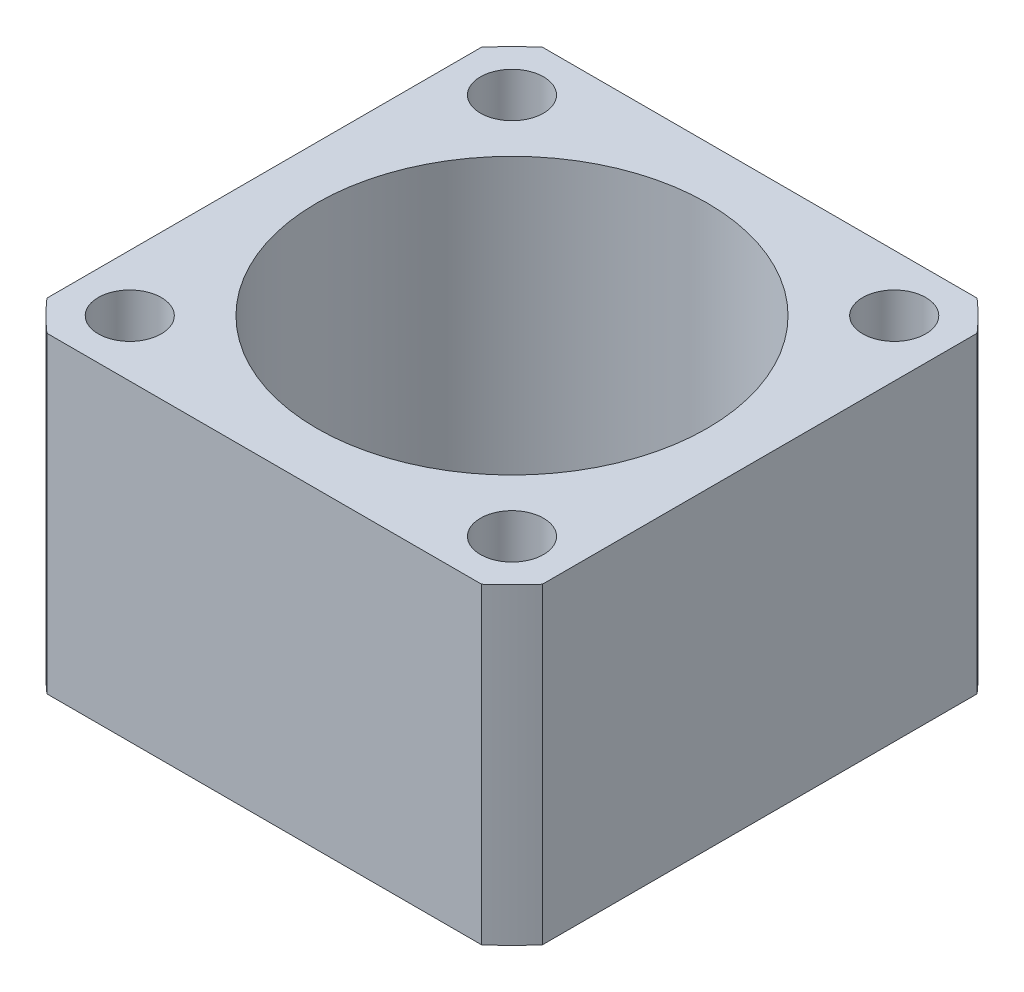
ISO-10303-21;
HEADER;
FILE_DESCRIPTION(('STEP AP214'),'2;1');
FILE_NAME('part.step','',(''),(''),'','','');
FILE_SCHEMA(('AUTOMOTIVE_DESIGN { 1 0 10303 214 1 1 1 1 }'));
ENDSEC;
DATA;
#1=APPLICATION_CONTEXT('core data for automotive mechanical design processes');
#2=APPLICATION_PROTOCOL_DEFINITION('international standard','automotive_design',2000,#1);
#3=PRODUCT_CONTEXT('',#1,'mechanical');
#4=PRODUCT('Part','Part','',(#3));
#5=PRODUCT_RELATED_PRODUCT_CATEGORY('part','',(#4));
#6=PRODUCT_DEFINITION_FORMATION('','',#4);
#7=PRODUCT_DEFINITION_CONTEXT('part definition',#1,'design');
#8=PRODUCT_DEFINITION('design','',#6,#7);
#9=PRODUCT_DEFINITION_SHAPE('','',#8);
#10=(LENGTH_UNIT() NAMED_UNIT(*) SI_UNIT(.MILLI.,.METRE.));
#11=(NAMED_UNIT(*) PLANE_ANGLE_UNIT() SI_UNIT($,.RADIAN.));
#12=(NAMED_UNIT(*) SI_UNIT($,.STERADIAN.) SOLID_ANGLE_UNIT());
#13=UNCERTAINTY_MEASURE_WITH_UNIT(LENGTH_MEASURE(1.E-05),#10,'distance_accuracy_value','');
#14=(GEOMETRIC_REPRESENTATION_CONTEXT(3) GLOBAL_UNCERTAINTY_ASSIGNED_CONTEXT((#13)) GLOBAL_UNIT_ASSIGNED_CONTEXT((#10,
#11,#12)) REPRESENTATION_CONTEXT('',''));
#15=CARTESIAN_POINT('',(0.,0.,0.));
#16=DIRECTION('',(0.,0.,1.));
#17=DIRECTION('',(1.,0.,0.));
#18=AXIS2_PLACEMENT_3D('',#15,#16,#17);
#19=CARTESIAN_POINT('',(0.,10.4,0.));
#20=DIRECTION('',(0.,1.,0.));
#21=DIRECTION('',(1.,0.,0.));
#22=AXIS2_PLACEMENT_3D('',#19,#20,#21);
#23=PLANE('',#22);
#24=CARTESIAN_POINT('',(0.,10.4,0.));
#25=DIRECTION('',(0.,-1.,0.));
#26=DIRECTION('',(1.,0.,0.));
#27=AXIS2_PLACEMENT_3D('',#24,#25,#26);
#28=CIRCLE('',#27,6.5);
#29=CARTESIAN_POINT('',(-6.5,10.4,0.));
#30=VERTEX_POINT('',#29);
#31=EDGE_CURVE('E223',#30,#30,#28,.T.);
#32=ORIENTED_EDGE('',*,*,#31,.T.);
#33=EDGE_LOOP('',(#32));
#34=FACE_BOUND('',#33,.T.);
#35=CARTESIAN_POINT('',(-6.36396103067893,10.4,-6.36396103067893));
#36=DIRECTION('',(0.,-1.,0.));
#37=DIRECTION('',(1.,0.,0.));
#38=AXIS2_PLACEMENT_3D('',#35,#36,#37);
#39=CIRCLE('',#38,1.05);
#40=CARTESIAN_POINT('',(-7.41396103067893,10.4,-6.36396103067893));
#41=VERTEX_POINT('',#40);
#42=EDGE_CURVE('E218',#41,#41,#39,.T.);
#43=ORIENTED_EDGE('',*,*,#42,.T.);
#44=EDGE_LOOP('',(#43));
#45=FACE_BOUND('',#44,.T.);
#46=CARTESIAN_POINT('',(6.36396103067893,10.4,-6.36396103067893));
#47=DIRECTION('',(0.,-1.,0.));
#48=DIRECTION('',(1.,0.,0.));
#49=AXIS2_PLACEMENT_3D('',#46,#47,#48);
#50=CIRCLE('',#49,1.05);
#51=CARTESIAN_POINT('',(5.31396103067893,10.4,-6.36396103067893));
#52=VERTEX_POINT('',#51);
#53=EDGE_CURVE('E205',#52,#52,#50,.T.);
#54=ORIENTED_EDGE('',*,*,#53,.T.);
#55=EDGE_LOOP('',(#54));
#56=FACE_BOUND('',#55,.T.);
#57=CARTESIAN_POINT('',(-6.36396103067893,10.4,6.36396103067893));
#58=DIRECTION('',(0.,-1.,0.));
#59=DIRECTION('',(1.,0.,0.));
#60=AXIS2_PLACEMENT_3D('',#57,#58,#59);
#61=CIRCLE('',#60,1.05);
#62=CARTESIAN_POINT('',(-7.41396103067893,10.4,6.36396103067893));
#63=VERTEX_POINT('',#62);
#64=EDGE_CURVE('E170',#63,#63,#61,.T.);
#65=ORIENTED_EDGE('',*,*,#64,.T.);
#66=EDGE_LOOP('',(#65));
#67=FACE_BOUND('',#66,.T.);
#68=CARTESIAN_POINT('',(6.36396103067893,10.4,6.36396103067893));
#69=DIRECTION('',(0.,-1.,0.));
#70=DIRECTION('',(1.,0.,0.));
#71=AXIS2_PLACEMENT_3D('',#68,#69,#70);
#72=CIRCLE('',#71,1.05);
#73=CARTESIAN_POINT('',(5.31396103067893,10.4,6.36396103067893));
#74=VERTEX_POINT('',#73);
#75=EDGE_CURVE('E29',#74,#74,#72,.T.);
#76=ORIENTED_EDGE('',*,*,#75,.T.);
#77=EDGE_LOOP('',(#76));
#78=FACE_BOUND('',#77,.T.);
#79=DIRECTION('',(0.,0.,-1.));
#80=VECTOR('',#79,1.);
#81=CARTESIAN_POINT('',(8.25,10.4,-3.61898207373289));
#82=LINE('',#81,#80);
#83=CARTESIAN_POINT('',(8.25,10.4,7.23796414746578));
#84=VERTEX_POINT('',#83);
#85=CARTESIAN_POINT('',(8.25,10.4,-7.23796414746578));
#86=VERTEX_POINT('',#85);
#87=EDGE_CURVE('E229',#84,#86,#82,.T.);
#88=ORIENTED_EDGE('',*,*,#87,.T.);
#89=CARTESIAN_POINT('',(0.,10.4,0.));
#90=DIRECTION('',(0.,1.,0.));
#91=DIRECTION('',(1.,0.,0.));
#92=AXIS2_PLACEMENT_3D('',#89,#90,#91);
#93=CIRCLE('',#92,10.975);
#94=CARTESIAN_POINT('',(7.23796414746578,10.4,-8.25));
#95=VERTEX_POINT('',#94);
#96=EDGE_CURVE('E89',#86,#95,#93,.T.);
#97=ORIENTED_EDGE('',*,*,#96,.T.);
#98=DIRECTION('',(-1.,0.,0.));
#99=VECTOR('',#98,1.);
#100=CARTESIAN_POINT('',(-3.61898207373289,10.4,-8.25));
#101=LINE('',#100,#99);
#102=CARTESIAN_POINT('',(-7.23796414746578,10.4,-8.25));
#103=VERTEX_POINT('',#102);
#104=EDGE_CURVE('E240',#95,#103,#101,.T.);
#105=ORIENTED_EDGE('',*,*,#104,.T.);
#106=CARTESIAN_POINT('',(0.,10.4,0.));
#107=DIRECTION('',(0.,1.,0.));
#108=DIRECTION('',(1.,0.,0.));
#109=AXIS2_PLACEMENT_3D('',#106,#107,#108);
#110=CIRCLE('',#109,10.975);
#111=CARTESIAN_POINT('',(-8.25,10.4,-7.23796414746578));
#112=VERTEX_POINT('',#111);
#113=EDGE_CURVE('E101',#103,#112,#110,.T.);
#114=ORIENTED_EDGE('',*,*,#113,.T.);
#115=DIRECTION('',(0.,0.,1.));
#116=VECTOR('',#115,1.);
#117=CARTESIAN_POINT('',(-8.25,10.4,3.61898207373289));
#118=LINE('',#117,#116);
#119=CARTESIAN_POINT('',(-8.25,10.4,7.23796414746578));
#120=VERTEX_POINT('',#119);
#121=EDGE_CURVE('E226',#112,#120,#118,.T.);
#122=ORIENTED_EDGE('',*,*,#121,.T.);
#123=CARTESIAN_POINT('',(0.,10.4,0.));
#124=DIRECTION('',(0.,1.,0.));
#125=DIRECTION('',(1.,0.,0.));
#126=AXIS2_PLACEMENT_3D('',#123,#124,#125);
#127=CIRCLE('',#126,10.975);
#128=CARTESIAN_POINT('',(-7.23796414746578,10.4,8.25));
#129=VERTEX_POINT('',#128);
#130=EDGE_CURVE('E133',#120,#129,#127,.T.);
#131=ORIENTED_EDGE('',*,*,#130,.T.);
#132=DIRECTION('',(1.,0.,0.));
#133=VECTOR('',#132,1.);
#134=CARTESIAN_POINT('',(3.61898207373289,10.4,8.25));
#135=LINE('',#134,#133);
#136=CARTESIAN_POINT('',(7.23796414746578,10.4,8.25));
#137=VERTEX_POINT('',#136);
#138=EDGE_CURVE('E188',#129,#137,#135,.T.);
#139=ORIENTED_EDGE('',*,*,#138,.T.);
#140=CARTESIAN_POINT('',(0.,10.4,0.));
#141=DIRECTION('',(0.,1.,0.));
#142=DIRECTION('',(1.,0.,0.));
#143=AXIS2_PLACEMENT_3D('',#140,#141,#142);
#144=CIRCLE('',#143,10.975);
#145=EDGE_CURVE('E184',#137,#84,#144,.T.);
#146=ORIENTED_EDGE('',*,*,#145,.T.);
#147=EDGE_LOOP('',(#88,#97,#105,#114,#122,#131,#139,#146));
#148=FACE_BOUND('',#147,.T.);
#149=ADVANCED_FACE('F19',(#34,#45,#56,#67,#78,#148),#23,.T.);
#150=CARTESIAN_POINT('',(6.36396103067893,0.,6.36396103067893));
#151=DIRECTION('',(0.,1.,0.));
#152=DIRECTION('',(1.,0.,0.));
#153=AXIS2_PLACEMENT_3D('',#150,#151,#152);
#154=CYLINDRICAL_SURFACE('',#153,1.05);
#155=ORIENTED_EDGE('',*,*,#75,.F.);
#156=DIRECTION('',(0.,-1.,0.));
#157=VECTOR('',#156,1.);
#158=CARTESIAN_POINT('',(5.31396103067893,0.,6.36396103067893));
#159=LINE('',#158,#157);
#160=CARTESIAN_POINT('',(5.31396103067893,0.,6.36396103067893));
#161=VERTEX_POINT('',#160);
#162=EDGE_CURVE('E11',#74,#161,#159,.T.);
#163=ORIENTED_EDGE('',*,*,#162,.T.);
#164=CARTESIAN_POINT('',(6.36396103067893,0.,6.36396103067893));
#165=DIRECTION('',(0.,-1.,0.));
#166=DIRECTION('',(1.,0.,0.));
#167=AXIS2_PLACEMENT_3D('',#164,#165,#166);
#168=CIRCLE('',#167,1.05);
#169=EDGE_CURVE('E23',#161,#161,#168,.T.);
#170=ORIENTED_EDGE('',*,*,#169,.T.);
#171=ORIENTED_EDGE('',*,*,#162,.F.);
#172=EDGE_LOOP('',(#155,#163,#170,#171));
#173=FACE_BOUND('',#172,.T.);
#174=ADVANCED_FACE('F21',(#173),#154,.F.);
#175=CARTESIAN_POINT('',(-6.36396103067893,0.,6.36396103067893));
#176=DIRECTION('',(0.,1.,0.));
#177=DIRECTION('',(1.,0.,0.));
#178=AXIS2_PLACEMENT_3D('',#175,#176,#177);
#179=CYLINDRICAL_SURFACE('',#178,1.05);
#180=ORIENTED_EDGE('',*,*,#64,.F.);
#181=DIRECTION('',(0.,-1.,0.));
#182=VECTOR('',#181,1.);
#183=CARTESIAN_POINT('',(-7.41396103067893,0.,6.36396103067893));
#184=LINE('',#183,#182);
#185=CARTESIAN_POINT('',(-7.41396103067893,0.,6.36396103067893));
#186=VERTEX_POINT('',#185);
#187=EDGE_CURVE('E53',#63,#186,#184,.T.);
#188=ORIENTED_EDGE('',*,*,#187,.T.);
#189=CARTESIAN_POINT('',(-6.36396103067893,0.,6.36396103067893));
#190=DIRECTION('',(0.,-1.,0.));
#191=DIRECTION('',(1.,0.,0.));
#192=AXIS2_PLACEMENT_3D('',#189,#190,#191);
#193=CIRCLE('',#192,1.05);
#194=EDGE_CURVE('E169',#186,#186,#193,.T.);
#195=ORIENTED_EDGE('',*,*,#194,.T.);
#196=ORIENTED_EDGE('',*,*,#187,.F.);
#197=EDGE_LOOP('',(#180,#188,#195,#196));
#198=FACE_BOUND('',#197,.T.);
#199=ADVANCED_FACE('F167',(#198),#179,.F.);
#200=CARTESIAN_POINT('',(6.36396103067893,0.,-6.36396103067893));
#201=DIRECTION('',(0.,1.,0.));
#202=DIRECTION('',(1.,0.,0.));
#203=AXIS2_PLACEMENT_3D('',#200,#201,#202);
#204=CYLINDRICAL_SURFACE('',#203,1.05);
#205=ORIENTED_EDGE('',*,*,#53,.F.);
#206=DIRECTION('',(0.,-1.,0.));
#207=VECTOR('',#206,1.);
#208=CARTESIAN_POINT('',(5.31396103067893,0.,-6.36396103067893));
#209=LINE('',#208,#207);
#210=CARTESIAN_POINT('',(5.31396103067893,0.,-6.36396103067893));
#211=VERTEX_POINT('',#210);
#212=EDGE_CURVE('E179',#52,#211,#209,.T.);
#213=ORIENTED_EDGE('',*,*,#212,.T.);
#214=CARTESIAN_POINT('',(6.36396103067893,0.,-6.36396103067893));
#215=DIRECTION('',(0.,-1.,0.));
#216=DIRECTION('',(1.,0.,0.));
#217=AXIS2_PLACEMENT_3D('',#214,#215,#216);
#218=CIRCLE('',#217,1.05);
#219=EDGE_CURVE('E201',#211,#211,#218,.T.);
#220=ORIENTED_EDGE('',*,*,#219,.T.);
#221=ORIENTED_EDGE('',*,*,#212,.F.);
#222=EDGE_LOOP('',(#205,#213,#220,#221));
#223=FACE_BOUND('',#222,.T.);
#224=ADVANCED_FACE('F349',(#223),#204,.F.);
#225=CARTESIAN_POINT('',(-6.36396103067893,0.,-6.36396103067893));
#226=DIRECTION('',(0.,1.,0.));
#227=DIRECTION('',(1.,0.,0.));
#228=AXIS2_PLACEMENT_3D('',#225,#226,#227);
#229=CYLINDRICAL_SURFACE('',#228,1.05);
#230=ORIENTED_EDGE('',*,*,#42,.F.);
#231=DIRECTION('',(0.,-1.,0.));
#232=VECTOR('',#231,1.);
#233=CARTESIAN_POINT('',(-7.41396103067893,0.,-6.36396103067893));
#234=LINE('',#233,#232);
#235=CARTESIAN_POINT('',(-7.41396103067893,0.,-6.36396103067893));
#236=VERTEX_POINT('',#235);
#237=EDGE_CURVE('E209',#41,#236,#234,.T.);
#238=ORIENTED_EDGE('',*,*,#237,.T.);
#239=CARTESIAN_POINT('',(-6.36396103067893,0.,-6.36396103067893));
#240=DIRECTION('',(0.,-1.,0.));
#241=DIRECTION('',(1.,0.,0.));
#242=AXIS2_PLACEMENT_3D('',#239,#240,#241);
#243=CIRCLE('',#242,1.05);
#244=EDGE_CURVE('E199',#236,#236,#243,.T.);
#245=ORIENTED_EDGE('',*,*,#244,.T.);
#246=ORIENTED_EDGE('',*,*,#237,.F.);
#247=EDGE_LOOP('',(#230,#238,#245,#246));
#248=FACE_BOUND('',#247,.T.);
#249=ADVANCED_FACE('F347',(#248),#229,.F.);
#250=CARTESIAN_POINT('',(0.,0.,0.));
#251=DIRECTION('',(0.,1.,0.));
#252=DIRECTION('',(1.,0.,0.));
#253=AXIS2_PLACEMENT_3D('',#250,#251,#252);
#254=CYLINDRICAL_SURFACE('',#253,6.5);
#255=ORIENTED_EDGE('',*,*,#31,.F.);
#256=DIRECTION('',(0.,-1.,0.));
#257=VECTOR('',#256,1.);
#258=CARTESIAN_POINT('',(-6.5,0.,0.));
#259=LINE('',#258,#257);
#260=CARTESIAN_POINT('',(-6.5,0.,0.));
#261=VERTEX_POINT('',#260);
#262=EDGE_CURVE('E159',#30,#261,#259,.T.);
#263=ORIENTED_EDGE('',*,*,#262,.T.);
#264=CARTESIAN_POINT('',(0.,0.,0.));
#265=DIRECTION('',(0.,-1.,0.));
#266=DIRECTION('',(1.,0.,0.));
#267=AXIS2_PLACEMENT_3D('',#264,#265,#266);
#268=CIRCLE('',#267,6.5);
#269=EDGE_CURVE('E196',#261,#261,#268,.T.);
#270=ORIENTED_EDGE('',*,*,#269,.T.);
#271=ORIENTED_EDGE('',*,*,#262,.F.);
#272=EDGE_LOOP('',(#255,#263,#270,#271));
#273=FACE_BOUND('',#272,.T.);
#274=ADVANCED_FACE('F333',(#273),#254,.F.);
#275=CARTESIAN_POINT('',(0.,0.,0.));
#276=DIRECTION('',(0.,1.,0.));
#277=DIRECTION('',(1.,0.,0.));
#278=AXIS2_PLACEMENT_3D('',#275,#276,#277);
#279=CYLINDRICAL_SURFACE('',#278,10.975);
#280=DIRECTION('',(0.,-1.,0.));
#281=VECTOR('',#280,1.);
#282=CARTESIAN_POINT('',(8.25,0.,-7.23796414746578));
#283=LINE('',#282,#281);
#284=CARTESIAN_POINT('',(8.25,0.,-7.23796414746578));
#285=VERTEX_POINT('',#284);
#286=EDGE_CURVE('E244',#86,#285,#283,.T.);
#287=ORIENTED_EDGE('',*,*,#286,.T.);
#288=CARTESIAN_POINT('',(0.,0.,0.));
#289=DIRECTION('',(0.,1.,0.));
#290=DIRECTION('',(1.,0.,0.));
#291=AXIS2_PLACEMENT_3D('',#288,#289,#290);
#292=CIRCLE('',#291,10.975);
#293=CARTESIAN_POINT('',(7.23796414746578,0.,-8.25));
#294=VERTEX_POINT('',#293);
#295=EDGE_CURVE('E200',#285,#294,#292,.T.);
#296=ORIENTED_EDGE('',*,*,#295,.T.);
#297=DIRECTION('',(0.,1.,0.));
#298=VECTOR('',#297,1.);
#299=CARTESIAN_POINT('',(7.23796414746578,0.,-8.25));
#300=LINE('',#299,#298);
#301=EDGE_CURVE('E243',#294,#95,#300,.T.);
#302=ORIENTED_EDGE('',*,*,#301,.T.);
#303=ORIENTED_EDGE('',*,*,#96,.F.);
#304=EDGE_LOOP('',(#287,#296,#302,#303));
#305=FACE_BOUND('',#304,.T.);
#306=ADVANCED_FACE('F316',(#305),#279,.T.);
#307=CARTESIAN_POINT('',(0.,0.,0.));
#308=DIRECTION('',(0.,1.,0.));
#309=DIRECTION('',(1.,0.,0.));
#310=AXIS2_PLACEMENT_3D('',#307,#308,#309);
#311=CYLINDRICAL_SURFACE('',#310,10.975);
#312=DIRECTION('',(0.,1.,0.));
#313=VECTOR('',#312,1.);
#314=CARTESIAN_POINT('',(8.25,0.,7.23796414746578));
#315=LINE('',#314,#313);
#316=CARTESIAN_POINT('',(8.25,0.,7.23796414746578));
#317=VERTEX_POINT('',#316);
#318=EDGE_CURVE('E232',#317,#84,#315,.T.);
#319=ORIENTED_EDGE('',*,*,#318,.T.);
#320=ORIENTED_EDGE('',*,*,#145,.F.);
#321=DIRECTION('',(0.,-1.,0.));
#322=VECTOR('',#321,1.);
#323=CARTESIAN_POINT('',(7.23796414746578,0.,8.25));
#324=LINE('',#323,#322);
#325=CARTESIAN_POINT('',(7.23796414746578,0.,8.25));
#326=VERTEX_POINT('',#325);
#327=EDGE_CURVE('E195',#137,#326,#324,.T.);
#328=ORIENTED_EDGE('',*,*,#327,.T.);
#329=CARTESIAN_POINT('',(0.,0.,0.));
#330=DIRECTION('',(0.,1.,0.));
#331=DIRECTION('',(1.,0.,0.));
#332=AXIS2_PLACEMENT_3D('',#329,#330,#331);
#333=CIRCLE('',#332,10.975);
#334=EDGE_CURVE('E210',#326,#317,#333,.T.);
#335=ORIENTED_EDGE('',*,*,#334,.T.);
#336=EDGE_LOOP('',(#319,#320,#328,#335));
#337=FACE_BOUND('',#336,.T.);
#338=ADVANCED_FACE('F324',(#337),#311,.T.);
#339=CARTESIAN_POINT('',(0.,0.,0.));
#340=DIRECTION('',(0.,1.,0.));
#341=DIRECTION('',(1.,0.,0.));
#342=AXIS2_PLACEMENT_3D('',#339,#340,#341);
#343=CYLINDRICAL_SURFACE('',#342,10.975);
#344=DIRECTION('',(0.,-1.,0.));
#345=VECTOR('',#344,1.);
#346=CARTESIAN_POINT('',(-7.23796414746578,0.,-8.25));
#347=LINE('',#346,#345);
#348=CARTESIAN_POINT('',(-7.23796414746578,0.,-8.25));
#349=VERTEX_POINT('',#348);
#350=EDGE_CURVE('E185',#103,#349,#347,.T.);
#351=ORIENTED_EDGE('',*,*,#350,.T.);
#352=CARTESIAN_POINT('',(0.,0.,0.));
#353=DIRECTION('',(0.,1.,0.));
#354=DIRECTION('',(1.,0.,0.));
#355=AXIS2_PLACEMENT_3D('',#352,#353,#354);
#356=CIRCLE('',#355,10.975);
#357=CARTESIAN_POINT('',(-8.25,0.,-7.23796414746578));
#358=VERTEX_POINT('',#357);
#359=EDGE_CURVE('E235',#349,#358,#356,.T.);
#360=ORIENTED_EDGE('',*,*,#359,.T.);
#361=DIRECTION('',(0.,1.,0.));
#362=VECTOR('',#361,1.);
#363=CARTESIAN_POINT('',(-8.25,0.,-7.23796414746578));
#364=LINE('',#363,#362);
#365=EDGE_CURVE('E215',#358,#112,#364,.T.);
#366=ORIENTED_EDGE('',*,*,#365,.T.);
#367=ORIENTED_EDGE('',*,*,#113,.F.);
#368=EDGE_LOOP('',(#351,#360,#366,#367));
#369=FACE_BOUND('',#368,.T.);
#370=ADVANCED_FACE('F311',(#369),#343,.T.);
#371=CARTESIAN_POINT('',(0.,0.,0.));
#372=DIRECTION('',(0.,1.,0.));
#373=DIRECTION('',(1.,0.,0.));
#374=AXIS2_PLACEMENT_3D('',#371,#372,#373);
#375=CYLINDRICAL_SURFACE('',#374,10.975);
#376=DIRECTION('',(0.,1.,0.));
#377=VECTOR('',#376,1.);
#378=CARTESIAN_POINT('',(-7.23796414746578,0.,8.25));
#379=LINE('',#378,#377);
#380=CARTESIAN_POINT('',(-7.23796414746578,0.,8.25));
#381=VERTEX_POINT('',#380);
#382=EDGE_CURVE('E221',#381,#129,#379,.T.);
#383=ORIENTED_EDGE('',*,*,#382,.T.);
#384=ORIENTED_EDGE('',*,*,#130,.F.);
#385=DIRECTION('',(0.,-1.,0.));
#386=VECTOR('',#385,1.);
#387=CARTESIAN_POINT('',(-8.25,0.,7.23796414746578));
#388=LINE('',#387,#386);
#389=CARTESIAN_POINT('',(-8.25,0.,7.23796414746578));
#390=VERTEX_POINT('',#389);
#391=EDGE_CURVE('E194',#120,#390,#388,.T.);
#392=ORIENTED_EDGE('',*,*,#391,.T.);
#393=CARTESIAN_POINT('',(0.,0.,0.));
#394=DIRECTION('',(0.,1.,0.));
#395=DIRECTION('',(1.,0.,0.));
#396=AXIS2_PLACEMENT_3D('',#393,#394,#395);
#397=CIRCLE('',#396,10.975);
#398=EDGE_CURVE('E214',#390,#381,#397,.T.);
#399=ORIENTED_EDGE('',*,*,#398,.T.);
#400=EDGE_LOOP('',(#383,#384,#392,#399));
#401=FACE_BOUND('',#400,.T.);
#402=ADVANCED_FACE('F291',(#401),#375,.T.);
#403=CARTESIAN_POINT('',(0.,0.,0.));
#404=DIRECTION('',(0.,1.,0.));
#405=DIRECTION('',(1.,0.,0.));
#406=AXIS2_PLACEMENT_3D('',#403,#404,#405);
#407=PLANE('',#406);
#408=ORIENTED_EDGE('',*,*,#169,.F.);
#409=EDGE_LOOP('',(#408));
#410=FACE_BOUND('',#409,.T.);
#411=ORIENTED_EDGE('',*,*,#194,.F.);
#412=EDGE_LOOP('',(#411));
#413=FACE_BOUND('',#412,.T.);
#414=ORIENTED_EDGE('',*,*,#219,.F.);
#415=EDGE_LOOP('',(#414));
#416=FACE_BOUND('',#415,.T.);
#417=ORIENTED_EDGE('',*,*,#244,.F.);
#418=EDGE_LOOP('',(#417));
#419=FACE_BOUND('',#418,.T.);
#420=ORIENTED_EDGE('',*,*,#269,.F.);
#421=EDGE_LOOP('',(#420));
#422=FACE_BOUND('',#421,.T.);
#423=DIRECTION('',(0.,0.,1.));
#424=VECTOR('',#423,1.);
#425=CARTESIAN_POINT('',(8.25,0.,-3.61898207373289));
#426=LINE('',#425,#424);
#427=EDGE_CURVE('E239',#285,#317,#426,.T.);
#428=ORIENTED_EDGE('',*,*,#427,.T.);
#429=ORIENTED_EDGE('',*,*,#334,.F.);
#430=DIRECTION('',(-1.,0.,0.));
#431=VECTOR('',#430,1.);
#432=CARTESIAN_POINT('',(3.61898207373289,0.,8.25));
#433=LINE('',#432,#431);
#434=EDGE_CURVE('E247',#326,#381,#433,.T.);
#435=ORIENTED_EDGE('',*,*,#434,.T.);
#436=ORIENTED_EDGE('',*,*,#398,.F.);
#437=DIRECTION('',(0.,0.,-1.));
#438=VECTOR('',#437,1.);
#439=CARTESIAN_POINT('',(-8.25,0.,3.61898207373289));
#440=LINE('',#439,#438);
#441=EDGE_CURVE('E190',#390,#358,#440,.T.);
#442=ORIENTED_EDGE('',*,*,#441,.T.);
#443=ORIENTED_EDGE('',*,*,#359,.F.);
#444=DIRECTION('',(1.,0.,0.));
#445=VECTOR('',#444,1.);
#446=CARTESIAN_POINT('',(-3.61898207373289,0.,-8.25));
#447=LINE('',#446,#445);
#448=EDGE_CURVE('E189',#349,#294,#447,.T.);
#449=ORIENTED_EDGE('',*,*,#448,.T.);
#450=ORIENTED_EDGE('',*,*,#295,.F.);
#451=EDGE_LOOP('',(#428,#429,#435,#436,#442,#443,#449,#450));
#452=FACE_BOUND('',#451,.T.);
#453=ADVANCED_FACE('F298',(#410,#413,#416,#419,#422,#452),#407,.F.);
#454=CARTESIAN_POINT('',(-8.25,-2.5,7.23796414746577));
#455=DIRECTION('',(1.,0.,0.));
#456=DIRECTION('',(0.,1.,0.));
#457=AXIS2_PLACEMENT_3D('',#454,#455,#456);
#458=PLANE('',#457);
#459=ORIENTED_EDGE('',*,*,#441,.F.);
#460=ORIENTED_EDGE('',*,*,#391,.F.);
#461=ORIENTED_EDGE('',*,*,#121,.F.);
#462=ORIENTED_EDGE('',*,*,#365,.F.);
#463=EDGE_LOOP('',(#459,#460,#461,#462));
#464=FACE_BOUND('',#463,.T.);
#465=ADVANCED_FACE('F307',(#464),#458,.F.);
#466=CARTESIAN_POINT('',(7.23796414746577,-2.5,8.25));
#467=DIRECTION('',(0.,0.,-1.));
#468=DIRECTION('',(0.,-1.,0.));
#469=AXIS2_PLACEMENT_3D('',#466,#467,#468);
#470=PLANE('',#469);
#471=ORIENTED_EDGE('',*,*,#138,.F.);
#472=ORIENTED_EDGE('',*,*,#382,.F.);
#473=ORIENTED_EDGE('',*,*,#434,.F.);
#474=ORIENTED_EDGE('',*,*,#327,.F.);
#475=EDGE_LOOP('',(#471,#472,#473,#474));
#476=FACE_BOUND('',#475,.T.);
#477=ADVANCED_FACE('F301',(#476),#470,.F.);
#478=CARTESIAN_POINT('',(-7.23796414746578,-2.5,-8.25));
#479=DIRECTION('',(0.,0.,1.));
#480=DIRECTION('',(1.,0.,0.));
#481=AXIS2_PLACEMENT_3D('',#478,#479,#480);
#482=PLANE('',#481);
#483=ORIENTED_EDGE('',*,*,#104,.F.);
#484=ORIENTED_EDGE('',*,*,#301,.F.);
#485=ORIENTED_EDGE('',*,*,#448,.F.);
#486=ORIENTED_EDGE('',*,*,#350,.F.);
#487=EDGE_LOOP('',(#483,#484,#485,#486));
#488=FACE_BOUND('',#487,.T.);
#489=ADVANCED_FACE('F314',(#488),#482,.F.);
#490=CARTESIAN_POINT('',(8.25,-2.5,-7.23796414746577));
#491=DIRECTION('',(-1.,0.,0.));
#492=DIRECTION('',(0.,0.,1.));
#493=AXIS2_PLACEMENT_3D('',#490,#491,#492);
#494=PLANE('',#493);
#495=ORIENTED_EDGE('',*,*,#87,.F.);
#496=ORIENTED_EDGE('',*,*,#318,.F.);
#497=ORIENTED_EDGE('',*,*,#427,.F.);
#498=ORIENTED_EDGE('',*,*,#286,.F.);
#499=EDGE_LOOP('',(#495,#496,#497,#498));
#500=FACE_BOUND('',#499,.T.);
#501=ADVANCED_FACE('F322',(#500),#494,.F.);
#502=CLOSED_SHELL('',(#149,#174,#199,#224,#249,#274,#306,#338,#370,#402,#453,#465,#477,#489,#501));
#503=MANIFOLD_SOLID_BREP('B1',#502);
#504=ADVANCED_BREP_SHAPE_REPRESENTATION('',(#18,#503),#14);
#505=SHAPE_DEFINITION_REPRESENTATION(#9,#504);
ENDSEC;
END-ISO-10303-21;
